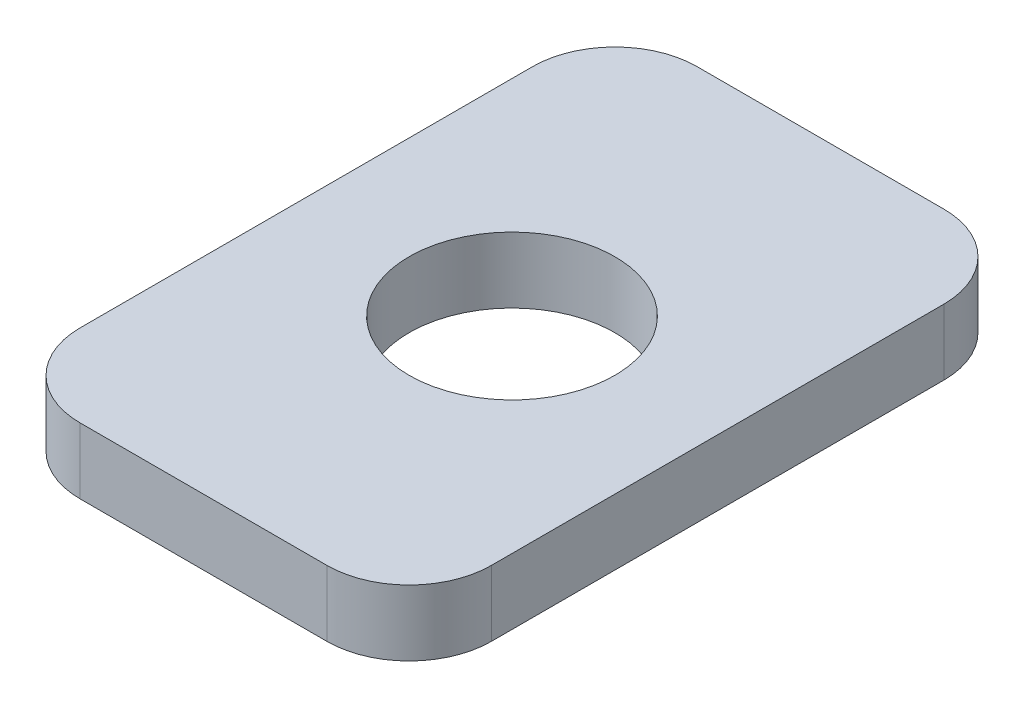
ISO-10303-21;
HEADER;
FILE_DESCRIPTION(('STEP AP214'),'2;1');
FILE_NAME('part.step','',(''),(''),'','','');
FILE_SCHEMA(('AUTOMOTIVE_DESIGN { 1 0 10303 214 1 1 1 1 }'));
ENDSEC;
DATA;
#1=APPLICATION_CONTEXT('core data for automotive mechanical design processes');
#2=APPLICATION_PROTOCOL_DEFINITION('international standard','automotive_design',2000,#1);
#3=PRODUCT_CONTEXT('',#1,'mechanical');
#4=PRODUCT('Part','Part','',(#3));
#5=PRODUCT_RELATED_PRODUCT_CATEGORY('part','',(#4));
#6=PRODUCT_DEFINITION_FORMATION('','',#4);
#7=PRODUCT_DEFINITION_CONTEXT('part definition',#1,'design');
#8=PRODUCT_DEFINITION('design','',#6,#7);
#9=PRODUCT_DEFINITION_SHAPE('','',#8);
#10=(LENGTH_UNIT() NAMED_UNIT(*) SI_UNIT(.MILLI.,.METRE.));
#11=(NAMED_UNIT(*) PLANE_ANGLE_UNIT() SI_UNIT($,.RADIAN.));
#12=(NAMED_UNIT(*) SI_UNIT($,.STERADIAN.) SOLID_ANGLE_UNIT());
#13=UNCERTAINTY_MEASURE_WITH_UNIT(LENGTH_MEASURE(1.E-05),#10,'distance_accuracy_value','');
#14=(GEOMETRIC_REPRESENTATION_CONTEXT(3) GLOBAL_UNCERTAINTY_ASSIGNED_CONTEXT((#13)) GLOBAL_UNIT_ASSIGNED_CONTEXT((#10,
#11,#12)) REPRESENTATION_CONTEXT('',''));
#15=CARTESIAN_POINT('',(0.,0.,0.));
#16=DIRECTION('',(0.,0.,1.));
#17=DIRECTION('',(1.,0.,0.));
#18=AXIS2_PLACEMENT_3D('',#15,#16,#17);
#19=CARTESIAN_POINT('',(0.,1.6,0.));
#20=DIRECTION('',(0.,1.,0.));
#21=DIRECTION('',(0.,0.,1.));
#22=AXIS2_PLACEMENT_3D('',#19,#20,#21);
#23=PLANE('',#22);
#24=CARTESIAN_POINT('',(0.,1.6,0.));
#25=DIRECTION('',(0.,1.,0.));
#26=DIRECTION('',(0.,0.,1.));
#27=AXIS2_PLACEMENT_3D('',#24,#25,#26);
#28=CIRCLE('',#27,2.5);
#29=CARTESIAN_POINT('',(0.,1.6,2.5));
#30=VERTEX_POINT('',#29);
#31=EDGE_CURVE('E128',#30,#30,#28,.F.);
#32=ORIENTED_EDGE('',*,*,#31,.T.);
#33=EDGE_LOOP('',(#32));
#34=FACE_BOUND('',#33,.T.);
#35=CARTESIAN_POINT('',(3.,1.6,-5.5));
#36=DIRECTION('',(0.,-1.,0.));
#37=DIRECTION('',(0.,0.,-1.));
#38=AXIS2_PLACEMENT_3D('',#35,#36,#37);
#39=CIRCLE('',#38,2.);
#40=CARTESIAN_POINT('',(3.,1.6,-7.5));
#41=VERTEX_POINT('',#40);
#42=CARTESIAN_POINT('',(5.,1.6,-5.5));
#43=VERTEX_POINT('',#42);
#44=EDGE_CURVE('E133',#41,#43,#39,.T.);
#45=ORIENTED_EDGE('',*,*,#44,.F.);
#46=DIRECTION('',(-1.,0.,0.));
#47=VECTOR('',#46,1.);
#48=CARTESIAN_POINT('',(5.,1.6,-7.5));
#49=LINE('',#48,#47);
#50=CARTESIAN_POINT('',(-3.,1.6,-7.5));
#51=VERTEX_POINT('',#50);
#52=EDGE_CURVE('E108',#51,#41,#49,.F.);
#53=ORIENTED_EDGE('',*,*,#52,.F.);
#54=CARTESIAN_POINT('',(-3.,1.6,-5.5));
#55=DIRECTION('',(0.,-1.,0.));
#56=DIRECTION('',(0.,0.,-1.));
#57=AXIS2_PLACEMENT_3D('',#54,#55,#56);
#58=CIRCLE('',#57,2.);
#59=CARTESIAN_POINT('',(-5.,1.6,-5.5));
#60=VERTEX_POINT('',#59);
#61=EDGE_CURVE('E95',#60,#51,#58,.T.);
#62=ORIENTED_EDGE('',*,*,#61,.F.);
#63=DIRECTION('',(0.,0.,1.));
#64=VECTOR('',#63,1.);
#65=CARTESIAN_POINT('',(-5.,1.6,-7.5));
#66=LINE('',#65,#64);
#67=CARTESIAN_POINT('',(-5.,1.6,5.5));
#68=VERTEX_POINT('',#67);
#69=EDGE_CURVE('E91',#68,#60,#66,.F.);
#70=ORIENTED_EDGE('',*,*,#69,.F.);
#71=CARTESIAN_POINT('',(-3.,1.6,5.5));
#72=DIRECTION('',(0.,-1.,0.));
#73=DIRECTION('',(0.,0.,-1.));
#74=AXIS2_PLACEMENT_3D('',#71,#72,#73);
#75=CIRCLE('',#74,2.);
#76=CARTESIAN_POINT('',(-3.,1.6,7.5));
#77=VERTEX_POINT('',#76);
#78=EDGE_CURVE('E19',#77,#68,#75,.T.);
#79=ORIENTED_EDGE('',*,*,#78,.F.);
#80=DIRECTION('',(1.,0.,0.));
#81=VECTOR('',#80,1.);
#82=CARTESIAN_POINT('',(-5.,1.6,7.5));
#83=LINE('',#82,#81);
#84=CARTESIAN_POINT('',(3.,1.6,7.5));
#85=VERTEX_POINT('',#84);
#86=EDGE_CURVE('E78',#85,#77,#83,.F.);
#87=ORIENTED_EDGE('',*,*,#86,.F.);
#88=CARTESIAN_POINT('',(3.,1.6,5.5));
#89=DIRECTION('',(0.,-1.,0.));
#90=DIRECTION('',(0.,0.,-1.));
#91=AXIS2_PLACEMENT_3D('',#88,#89,#90);
#92=CIRCLE('',#91,2.);
#93=CARTESIAN_POINT('',(5.,1.6,5.5));
#94=VERTEX_POINT('',#93);
#95=EDGE_CURVE('E134',#94,#85,#92,.T.);
#96=ORIENTED_EDGE('',*,*,#95,.F.);
#97=DIRECTION('',(0.,0.,-1.));
#98=VECTOR('',#97,1.);
#99=CARTESIAN_POINT('',(5.,1.6,7.5));
#100=LINE('',#99,#98);
#101=EDGE_CURVE('E112',#43,#94,#100,.F.);
#102=ORIENTED_EDGE('',*,*,#101,.F.);
#103=EDGE_LOOP('',(#45,#53,#62,#70,#79,#87,#96,#102));
#104=FACE_BOUND('',#103,.T.);
#105=ADVANCED_FACE('F16',(#34,#104),#23,.T.);
#106=CARTESIAN_POINT('',(-5.,0.,-7.5));
#107=DIRECTION('',(-1.,0.,0.));
#108=DIRECTION('',(0.,0.,1.));
#109=AXIS2_PLACEMENT_3D('',#106,#107,#108);
#110=PLANE('',#109);
#111=DIRECTION('',(0.,-1.,0.));
#112=VECTOR('',#111,1.);
#113=CARTESIAN_POINT('',(-5.,4.16672,5.5));
#114=LINE('',#113,#112);
#115=CARTESIAN_POINT('',(-5.,0.,5.5));
#116=VERTEX_POINT('',#115);
#117=EDGE_CURVE('E87',#68,#116,#114,.T.);
#118=ORIENTED_EDGE('',*,*,#117,.F.);
#119=ORIENTED_EDGE('',*,*,#69,.T.);
#120=DIRECTION('',(0.,-1.,0.));
#121=VECTOR('',#120,1.);
#122=CARTESIAN_POINT('',(-5.,4.16672,-5.5));
#123=LINE('',#122,#121);
#124=CARTESIAN_POINT('',(-5.,0.,-5.5));
#125=VERTEX_POINT('',#124);
#126=EDGE_CURVE('E132',#125,#60,#123,.F.);
#127=ORIENTED_EDGE('',*,*,#126,.F.);
#128=DIRECTION('',(0.,0.,1.));
#129=VECTOR('',#128,1.);
#130=CARTESIAN_POINT('',(-5.,0.,0.));
#131=LINE('',#130,#129);
#132=EDGE_CURVE('E102',#125,#116,#131,.T.);
#133=ORIENTED_EDGE('',*,*,#132,.T.);
#134=EDGE_LOOP('',(#118,#119,#127,#133));
#135=FACE_BOUND('',#134,.T.);
#136=ADVANCED_FACE('F101',(#135),#110,.T.);
#137=CARTESIAN_POINT('',(-3.,4.16672,5.5));
#138=DIRECTION('',(0.,-1.,0.));
#139=DIRECTION('',(0.,0.,-1.));
#140=AXIS2_PLACEMENT_3D('',#137,#138,#139);
#141=CYLINDRICAL_SURFACE('',#140,2.);
#142=ORIENTED_EDGE('',*,*,#78,.T.);
#143=ORIENTED_EDGE('',*,*,#117,.T.);
#144=CARTESIAN_POINT('',(-3.,0.,5.5));
#145=DIRECTION('',(0.,-1.,0.));
#146=DIRECTION('',(0.,0.,-1.));
#147=AXIS2_PLACEMENT_3D('',#144,#145,#146);
#148=CIRCLE('',#147,2.);
#149=CARTESIAN_POINT('',(-3.,0.,7.5));
#150=VERTEX_POINT('',#149);
#151=EDGE_CURVE('E126',#116,#150,#148,.F.);
#152=ORIENTED_EDGE('',*,*,#151,.T.);
#153=DIRECTION('',(0.,1.,0.));
#154=VECTOR('',#153,1.);
#155=CARTESIAN_POINT('',(-3.,0.,7.5));
#156=LINE('',#155,#154);
#157=EDGE_CURVE('E89',#77,#150,#156,.F.);
#158=ORIENTED_EDGE('',*,*,#157,.F.);
#159=EDGE_LOOP('',(#142,#143,#152,#158));
#160=FACE_BOUND('',#159,.T.);
#161=ADVANCED_FACE('F84',(#160),#141,.T.);
#162=CARTESIAN_POINT('',(-5.,0.,7.5));
#163=DIRECTION('',(0.,0.,1.));
#164=DIRECTION('',(1.,0.,0.));
#165=AXIS2_PLACEMENT_3D('',#162,#163,#164);
#166=PLANE('',#165);
#167=ORIENTED_EDGE('',*,*,#157,.T.);
#168=DIRECTION('',(1.,0.,0.));
#169=VECTOR('',#168,1.);
#170=CARTESIAN_POINT('',(0.,0.,7.5));
#171=LINE('',#170,#169);
#172=CARTESIAN_POINT('',(3.,0.,7.5));
#173=VERTEX_POINT('',#172);
#174=EDGE_CURVE('E125',#150,#173,#171,.T.);
#175=ORIENTED_EDGE('',*,*,#174,.T.);
#176=DIRECTION('',(0.,-1.,0.));
#177=VECTOR('',#176,1.);
#178=CARTESIAN_POINT('',(3.,4.16672,7.5));
#179=LINE('',#178,#177);
#180=EDGE_CURVE('E114',#85,#173,#179,.T.);
#181=ORIENTED_EDGE('',*,*,#180,.F.);
#182=ORIENTED_EDGE('',*,*,#86,.T.);
#183=EDGE_LOOP('',(#167,#175,#181,#182));
#184=FACE_BOUND('',#183,.T.);
#185=ADVANCED_FACE('F140',(#184),#166,.T.);
#186=CARTESIAN_POINT('',(3.,4.16672,5.5));
#187=DIRECTION('',(0.,-1.,0.));
#188=DIRECTION('',(0.,0.,-1.));
#189=AXIS2_PLACEMENT_3D('',#186,#187,#188);
#190=CYLINDRICAL_SURFACE('',#189,2.);
#191=ORIENTED_EDGE('',*,*,#95,.T.);
#192=ORIENTED_EDGE('',*,*,#180,.T.);
#193=CARTESIAN_POINT('',(3.,0.,5.5));
#194=DIRECTION('',(0.,-1.,0.));
#195=DIRECTION('',(0.,0.,-1.));
#196=AXIS2_PLACEMENT_3D('',#193,#194,#195);
#197=CIRCLE('',#196,2.);
#198=CARTESIAN_POINT('',(5.,0.,5.5));
#199=VERTEX_POINT('',#198);
#200=EDGE_CURVE('E122',#173,#199,#197,.F.);
#201=ORIENTED_EDGE('',*,*,#200,.T.);
#202=DIRECTION('',(0.,1.,0.));
#203=VECTOR('',#202,1.);
#204=CARTESIAN_POINT('',(5.,0.,5.5));
#205=LINE('',#204,#203);
#206=EDGE_CURVE('E113',#94,#199,#205,.F.);
#207=ORIENTED_EDGE('',*,*,#206,.F.);
#208=EDGE_LOOP('',(#191,#192,#201,#207));
#209=FACE_BOUND('',#208,.T.);
#210=ADVANCED_FACE('F161',(#209),#190,.T.);
#211=CARTESIAN_POINT('',(5.,0.,7.5));
#212=DIRECTION('',(1.,0.,0.));
#213=DIRECTION('',(0.,0.,-1.));
#214=AXIS2_PLACEMENT_3D('',#211,#212,#213);
#215=PLANE('',#214);
#216=ORIENTED_EDGE('',*,*,#206,.T.);
#217=DIRECTION('',(0.,0.,1.));
#218=VECTOR('',#217,1.);
#219=CARTESIAN_POINT('',(5.,0.,0.));
#220=LINE('',#219,#218);
#221=CARTESIAN_POINT('',(5.,0.,-5.5));
#222=VERTEX_POINT('',#221);
#223=EDGE_CURVE('E121',#199,#222,#220,.F.);
#224=ORIENTED_EDGE('',*,*,#223,.T.);
#225=DIRECTION('',(0.,-1.,0.));
#226=VECTOR('',#225,1.);
#227=CARTESIAN_POINT('',(5.,4.16672,-5.5));
#228=LINE('',#227,#226);
#229=EDGE_CURVE('E110',#43,#222,#228,.T.);
#230=ORIENTED_EDGE('',*,*,#229,.F.);
#231=ORIENTED_EDGE('',*,*,#101,.T.);
#232=EDGE_LOOP('',(#216,#224,#230,#231));
#233=FACE_BOUND('',#232,.T.);
#234=ADVANCED_FACE('F157',(#233),#215,.T.);
#235=CARTESIAN_POINT('',(3.,4.16672,-5.5));
#236=DIRECTION('',(0.,-1.,0.));
#237=DIRECTION('',(0.,0.,-1.));
#238=AXIS2_PLACEMENT_3D('',#235,#236,#237);
#239=CYLINDRICAL_SURFACE('',#238,2.);
#240=ORIENTED_EDGE('',*,*,#44,.T.);
#241=ORIENTED_EDGE('',*,*,#229,.T.);
#242=CARTESIAN_POINT('',(3.,0.,-5.5));
#243=DIRECTION('',(0.,-1.,0.));
#244=DIRECTION('',(0.,0.,-1.));
#245=AXIS2_PLACEMENT_3D('',#242,#243,#244);
#246=CIRCLE('',#245,2.);
#247=CARTESIAN_POINT('',(3.,0.,-7.5));
#248=VERTEX_POINT('',#247);
#249=EDGE_CURVE('E118',#222,#248,#246,.F.);
#250=ORIENTED_EDGE('',*,*,#249,.T.);
#251=DIRECTION('',(0.,1.,0.));
#252=VECTOR('',#251,1.);
#253=CARTESIAN_POINT('',(3.,0.,-7.5));
#254=LINE('',#253,#252);
#255=EDGE_CURVE('E109',#41,#248,#254,.F.);
#256=ORIENTED_EDGE('',*,*,#255,.F.);
#257=EDGE_LOOP('',(#240,#241,#250,#256));
#258=FACE_BOUND('',#257,.T.);
#259=ADVANCED_FACE('F169',(#258),#239,.T.);
#260=CARTESIAN_POINT('',(5.,0.,-7.5));
#261=DIRECTION('',(0.,0.,-1.));
#262=DIRECTION('',(-1.,0.,0.));
#263=AXIS2_PLACEMENT_3D('',#260,#261,#262);
#264=PLANE('',#263);
#265=ORIENTED_EDGE('',*,*,#255,.T.);
#266=DIRECTION('',(1.,0.,0.));
#267=VECTOR('',#266,1.);
#268=CARTESIAN_POINT('',(0.,0.,-7.5));
#269=LINE('',#268,#267);
#270=CARTESIAN_POINT('',(-3.,0.,-7.5));
#271=VERTEX_POINT('',#270);
#272=EDGE_CURVE('E117',#248,#271,#269,.F.);
#273=ORIENTED_EDGE('',*,*,#272,.T.);
#274=DIRECTION('',(0.,-1.,0.));
#275=VECTOR('',#274,1.);
#276=CARTESIAN_POINT('',(-3.,4.16672,-7.5));
#277=LINE('',#276,#275);
#278=EDGE_CURVE('E34',#51,#271,#277,.T.);
#279=ORIENTED_EDGE('',*,*,#278,.F.);
#280=ORIENTED_EDGE('',*,*,#52,.T.);
#281=EDGE_LOOP('',(#265,#273,#279,#280));
#282=FACE_BOUND('',#281,.T.);
#283=ADVANCED_FACE('F186',(#282),#264,.T.);
#284=CARTESIAN_POINT('',(-3.,4.16672,-5.5));
#285=DIRECTION('',(0.,-1.,0.));
#286=DIRECTION('',(0.,0.,-1.));
#287=AXIS2_PLACEMENT_3D('',#284,#285,#286);
#288=CYLINDRICAL_SURFACE('',#287,2.);
#289=ORIENTED_EDGE('',*,*,#61,.T.);
#290=ORIENTED_EDGE('',*,*,#278,.T.);
#291=CARTESIAN_POINT('',(-3.,0.,-5.5));
#292=DIRECTION('',(0.,-1.,0.));
#293=DIRECTION('',(0.,0.,-1.));
#294=AXIS2_PLACEMENT_3D('',#291,#292,#293);
#295=CIRCLE('',#294,2.);
#296=EDGE_CURVE('E25',#271,#125,#295,.F.);
#297=ORIENTED_EDGE('',*,*,#296,.T.);
#298=ORIENTED_EDGE('',*,*,#126,.T.);
#299=EDGE_LOOP('',(#289,#290,#297,#298));
#300=FACE_BOUND('',#299,.T.);
#301=ADVANCED_FACE('F179',(#300),#288,.T.);
#302=CARTESIAN_POINT('',(0.,0.,0.));
#303=DIRECTION('',(0.,1.,0.));
#304=DIRECTION('',(0.,0.,1.));
#305=AXIS2_PLACEMENT_3D('',#302,#303,#304);
#306=CYLINDRICAL_SURFACE('',#305,2.5);
#307=ORIENTED_EDGE('',*,*,#31,.F.);
#308=EDGE_LOOP('',(#307));
#309=FACE_BOUND('',#308,.T.);
#310=CARTESIAN_POINT('',(0.,0.,0.));
#311=DIRECTION('',(0.,1.,0.));
#312=DIRECTION('',(0.,0.,1.));
#313=AXIS2_PLACEMENT_3D('',#310,#311,#312);
#314=CIRCLE('',#313,2.5);
#315=CARTESIAN_POINT('',(0.,0.,2.5));
#316=VERTEX_POINT('',#315);
#317=EDGE_CURVE('E11',#316,#316,#314,.F.);
#318=ORIENTED_EDGE('',*,*,#317,.T.);
#319=EDGE_LOOP('',(#318));
#320=FACE_BOUND('',#319,.T.);
#321=ADVANCED_FACE('F173',(#309,#320),#306,.F.);
#322=CARTESIAN_POINT('',(0.,0.,0.));
#323=DIRECTION('',(0.,1.,0.));
#324=DIRECTION('',(0.,0.,1.));
#325=AXIS2_PLACEMENT_3D('',#322,#323,#324);
#326=PLANE('',#325);
#327=ORIENTED_EDGE('',*,*,#317,.F.);
#328=EDGE_LOOP('',(#327));
#329=FACE_BOUND('',#328,.T.);
#330=ORIENTED_EDGE('',*,*,#272,.F.);
#331=ORIENTED_EDGE('',*,*,#249,.F.);
#332=ORIENTED_EDGE('',*,*,#223,.F.);
#333=ORIENTED_EDGE('',*,*,#200,.F.);
#334=ORIENTED_EDGE('',*,*,#174,.F.);
#335=ORIENTED_EDGE('',*,*,#151,.F.);
#336=ORIENTED_EDGE('',*,*,#132,.F.);
#337=ORIENTED_EDGE('',*,*,#296,.F.);
#338=EDGE_LOOP('',(#330,#331,#332,#333,#334,#335,#336,#337));
#339=FACE_BOUND('',#338,.T.);
#340=ADVANCED_FACE('F144',(#329,#339),#326,.F.);
#341=CLOSED_SHELL('',(#105,#136,#161,#185,#210,#234,#259,#283,#301,#321,#340));
#342=MANIFOLD_SOLID_BREP('B1',#341);
#343=ADVANCED_BREP_SHAPE_REPRESENTATION('',(#18,#342),#14);
#344=SHAPE_DEFINITION_REPRESENTATION(#9,#343);
ENDSEC;
END-ISO-10303-21;
